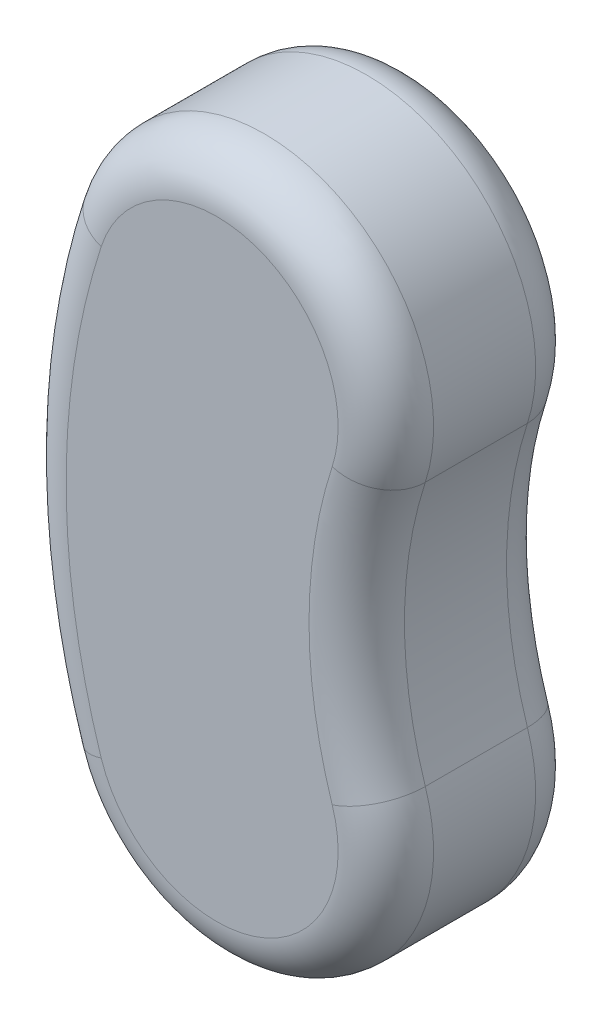
ISO-10303-21;
HEADER;
FILE_DESCRIPTION(('STEP AP214'),'2;1');
FILE_NAME('part.step','',(''),(''),'','','');
FILE_SCHEMA(('AUTOMOTIVE_DESIGN { 1 0 10303 214 1 1 1 1 }'));
ENDSEC;
DATA;
#1=APPLICATION_CONTEXT('core data for automotive mechanical design processes');
#2=APPLICATION_PROTOCOL_DEFINITION('international standard','automotive_design',2000,#1);
#3=PRODUCT_CONTEXT('',#1,'mechanical');
#4=PRODUCT('Part','Part','',(#3));
#5=PRODUCT_RELATED_PRODUCT_CATEGORY('part','',(#4));
#6=PRODUCT_DEFINITION_FORMATION('','',#4);
#7=PRODUCT_DEFINITION_CONTEXT('part definition',#1,'design');
#8=PRODUCT_DEFINITION('design','',#6,#7);
#9=PRODUCT_DEFINITION_SHAPE('','',#8);
#10=(LENGTH_UNIT() NAMED_UNIT(*) SI_UNIT(.MILLI.,.METRE.));
#11=(NAMED_UNIT(*) PLANE_ANGLE_UNIT() SI_UNIT($,.RADIAN.));
#12=(NAMED_UNIT(*) SI_UNIT($,.STERADIAN.) SOLID_ANGLE_UNIT());
#13=UNCERTAINTY_MEASURE_WITH_UNIT(LENGTH_MEASURE(1.E-05),#10,'distance_accuracy_value','');
#14=(GEOMETRIC_REPRESENTATION_CONTEXT(3) GLOBAL_UNCERTAINTY_ASSIGNED_CONTEXT((#13)) GLOBAL_UNIT_ASSIGNED_CONTEXT((#10,
#11,#12)) REPRESENTATION_CONTEXT('',''));
#15=CARTESIAN_POINT('',(0.,0.,0.));
#16=DIRECTION('',(0.,0.,1.));
#17=DIRECTION('',(1.,0.,0.));
#18=AXIS2_PLACEMENT_3D('',#15,#16,#17);
#19=CARTESIAN_POINT('',(33.7181235793706,10.9448911500431,41.4));
#20=DIRECTION('',(0.,0.,-1.));
#21=DIRECTION('',(-1.,0.,0.));
#22=AXIS2_PLACEMENT_3D('',#19,#20,#21);
#23=CYLINDRICAL_SURFACE('',#22,35.45);
#24=DIRECTION('',(0.,0.,-1.));
#25=VECTOR('',#24,1.);
#26=CARTESIAN_POINT('',(0.,0.,41.4));
#27=LINE('',#26,#25);
#28=CARTESIAN_POINT('',(0.,0.,31.4));
#29=VERTEX_POINT('',#28);
#30=CARTESIAN_POINT('',(0.,0.,10.));
#31=VERTEX_POINT('',#30);
#32=EDGE_CURVE('E180',#29,#31,#27,.T.);
#33=ORIENTED_EDGE('',*,*,#32,.T.);
#34=CARTESIAN_POINT('',(33.7181235793706,10.9448911500431,10.));
#35=DIRECTION('',(0.,0.,-1.));
#36=DIRECTION('',(-1.,0.,0.));
#37=AXIS2_PLACEMENT_3D('',#34,#35,#36);
#38=CIRCLE('',#37,35.45);
#39=CARTESIAN_POINT('',(67.4362471587413,21.8897823000861,10.));
#40=VERTEX_POINT('',#39);
#41=EDGE_CURVE('E133',#31,#40,#38,.F.);
#42=ORIENTED_EDGE('',*,*,#41,.T.);
#43=DIRECTION('',(0.,0.,-1.));
#44=VECTOR('',#43,1.);
#45=CARTESIAN_POINT('',(67.4362471587413,21.8897823000861,41.4));
#46=LINE('',#45,#44);
#47=CARTESIAN_POINT('',(67.4362471587413,21.8897823000861,31.4));
#48=VERTEX_POINT('',#47);
#49=EDGE_CURVE('E113',#48,#40,#46,.T.);
#50=ORIENTED_EDGE('',*,*,#49,.F.);
#51=CARTESIAN_POINT('',(33.7181235793706,10.9448911500431,31.4));
#52=DIRECTION('',(0.,0.,-1.));
#53=DIRECTION('',(-1.,0.,0.));
#54=AXIS2_PLACEMENT_3D('',#51,#52,#53);
#55=CIRCLE('',#54,35.45);
#56=EDGE_CURVE('E127',#48,#29,#55,.T.);
#57=ORIENTED_EDGE('',*,*,#56,.T.);
#58=EDGE_LOOP('',(#33,#42,#50,#57));
#59=FACE_BOUND('',#58,.T.);
#60=ADVANCED_FACE('F44',(#59),#23,.T.);
#61=CARTESIAN_POINT('',(152.47980390724,49.494891150043,41.4));
#62=DIRECTION('',(0.,0.,-1.));
#63=DIRECTION('',(-1.,0.,0.));
#64=AXIS2_PLACEMENT_3D('',#61,#62,#63);
#65=CYLINDRICAL_SURFACE('',#64,89.4116803278691);
#66=ORIENTED_EDGE('',*,*,#49,.T.);
#67=CARTESIAN_POINT('',(152.47980390724,49.494891150043,10.));
#68=DIRECTION('',(0.,0.,-1.));
#69=DIRECTION('',(-1.,0.,0.));
#70=AXIS2_PLACEMENT_3D('',#67,#68,#69);
#71=CIRCLE('',#70,89.4116803278691);
#72=CARTESIAN_POINT('',(67.4362471587413,77.1,10.));
#73=VERTEX_POINT('',#72);
#74=EDGE_CURVE('E11',#40,#73,#71,.T.);
#75=ORIENTED_EDGE('',*,*,#74,.T.);
#76=DIRECTION('',(0.,0.,-1.));
#77=VECTOR('',#76,1.);
#78=CARTESIAN_POINT('',(67.4362471587413,77.1,41.4));
#79=LINE('',#78,#77);
#80=CARTESIAN_POINT('',(67.4362471587413,77.1,31.4));
#81=VERTEX_POINT('',#80);
#82=EDGE_CURVE('E120',#81,#73,#79,.T.);
#83=ORIENTED_EDGE('',*,*,#82,.F.);
#84=CARTESIAN_POINT('',(152.47980390724,49.494891150043,31.4));
#85=DIRECTION('',(0.,0.,-1.));
#86=DIRECTION('',(-1.,0.,0.));
#87=AXIS2_PLACEMENT_3D('',#84,#85,#86);
#88=CIRCLE('',#87,89.4116803278691);
#89=EDGE_CURVE('E54',#81,#48,#88,.F.);
#90=ORIENTED_EDGE('',*,*,#89,.T.);
#91=EDGE_LOOP('',(#66,#75,#83,#90));
#92=FACE_BOUND('',#91,.T.);
#93=ADVANCED_FACE('F114',(#92),#65,.F.);
#94=CARTESIAN_POINT('',(33.7181235793706,88.044891150043,41.4));
#95=DIRECTION('',(0.,0.,-1.));
#96=DIRECTION('',(-1.,0.,0.));
#97=AXIS2_PLACEMENT_3D('',#94,#95,#96);
#98=CYLINDRICAL_SURFACE('',#97,35.45);
#99=ORIENTED_EDGE('',*,*,#82,.T.);
#100=CARTESIAN_POINT('',(33.7181235793706,88.044891150043,10.));
#101=DIRECTION('',(0.,0.,-1.));
#102=DIRECTION('',(-1.,0.,0.));
#103=AXIS2_PLACEMENT_3D('',#100,#101,#102);
#104=CIRCLE('',#103,35.45);
#105=CARTESIAN_POINT('',(0.,98.9897823000861,10.));
#106=VERTEX_POINT('',#105);
#107=EDGE_CURVE('E218',#73,#106,#104,.F.);
#108=ORIENTED_EDGE('',*,*,#107,.T.);
#109=DIRECTION('',(0.,0.,-1.));
#110=VECTOR('',#109,1.);
#111=CARTESIAN_POINT('',(0.,98.9897823000861,41.4));
#112=LINE('',#111,#110);
#113=CARTESIAN_POINT('',(0.,98.9897823000861,31.4));
#114=VERTEX_POINT('',#113);
#115=EDGE_CURVE('E183',#114,#106,#112,.T.);
#116=ORIENTED_EDGE('',*,*,#115,.F.);
#117=CARTESIAN_POINT('',(33.7181235793706,88.044891150043,31.4));
#118=DIRECTION('',(0.,0.,-1.));
#119=DIRECTION('',(-1.,0.,0.));
#120=AXIS2_PLACEMENT_3D('',#117,#118,#119);
#121=CIRCLE('',#120,35.45);
#122=EDGE_CURVE('E211',#114,#81,#121,.T.);
#123=ORIENTED_EDGE('',*,*,#122,.T.);
#124=EDGE_LOOP('',(#99,#108,#116,#123));
#125=FACE_BOUND('',#124,.T.);
#126=ADVANCED_FACE('F233',(#125),#98,.T.);
#127=CARTESIAN_POINT('',(152.47980390724,49.494891150043,41.4));
#128=DIRECTION('',(0.,0.,-1.));
#129=DIRECTION('',(-1.,0.,0.));
#130=AXIS2_PLACEMENT_3D('',#127,#128,#129);
#131=CYLINDRICAL_SURFACE('',#130,160.311680327869);
#132=ORIENTED_EDGE('',*,*,#115,.T.);
#133=CARTESIAN_POINT('',(152.47980390724,49.494891150043,10.));
#134=DIRECTION('',(0.,0.,-1.));
#135=DIRECTION('',(-1.,0.,0.));
#136=AXIS2_PLACEMENT_3D('',#133,#134,#135);
#137=CIRCLE('',#136,160.311680327869);
#138=EDGE_CURVE('E206',#106,#31,#137,.F.);
#139=ORIENTED_EDGE('',*,*,#138,.T.);
#140=ORIENTED_EDGE('',*,*,#32,.F.);
#141=CARTESIAN_POINT('',(152.47980390724,49.494891150043,31.4));
#142=DIRECTION('',(0.,0.,-1.));
#143=DIRECTION('',(-1.,0.,0.));
#144=AXIS2_PLACEMENT_3D('',#141,#142,#143);
#145=CIRCLE('',#144,160.311680327869);
#146=EDGE_CURVE('E210',#29,#114,#145,.T.);
#147=ORIENTED_EDGE('',*,*,#146,.T.);
#148=EDGE_LOOP('',(#132,#139,#140,#147));
#149=FACE_BOUND('',#148,.T.);
#150=ADVANCED_FACE('F235',(#149),#131,.T.);
#151=CARTESIAN_POINT('',(93.0989637433052,30.2198911500431,41.4));
#152=DIRECTION('',(0.,0.,-1.));
#153=DIRECTION('',(-1.,0.,0.));
#154=AXIS2_PLACEMENT_3D('',#151,#152,#153);
#155=PLANE('',#154);
#156=CARTESIAN_POINT('',(152.47980390724,49.494891150043,41.4));
#157=DIRECTION('',(0.,0.,-1.));
#158=DIRECTION('',(-1.,0.,0.));
#159=AXIS2_PLACEMENT_3D('',#156,#157,#158);
#160=CIRCLE('',#159,150.311680327869);
#161=CARTESIAN_POINT('',(9.51145940179707,95.9023658966889,41.4));
#162=VERTEX_POINT('',#161);
#163=CARTESIAN_POINT('',(9.51145940179711,3.08741640339717,41.4));
#164=VERTEX_POINT('',#163);
#165=EDGE_CURVE('E63',#162,#164,#160,.F.);
#166=ORIENTED_EDGE('',*,*,#165,.T.);
#167=CARTESIAN_POINT('',(33.7181235793706,10.9448911500431,41.4));
#168=DIRECTION('',(0.,0.,-1.));
#169=DIRECTION('',(-1.,0.,0.));
#170=AXIS2_PLACEMENT_3D('',#167,#168,#169);
#171=CIRCLE('',#170,25.45);
#172=CARTESIAN_POINT('',(57.9247877569442,18.8023658966889,41.4));
#173=VERTEX_POINT('',#172);
#174=EDGE_CURVE('E121',#164,#173,#171,.F.);
#175=ORIENTED_EDGE('',*,*,#174,.T.);
#176=CARTESIAN_POINT('',(152.47980390724,49.494891150043,41.4));
#177=DIRECTION('',(0.,0.,-1.));
#178=DIRECTION('',(-1.,0.,0.));
#179=AXIS2_PLACEMENT_3D('',#176,#177,#178);
#180=CIRCLE('',#179,99.4116803278691);
#181=CARTESIAN_POINT('',(57.9247877569442,80.1874164033972,41.4));
#182=VERTEX_POINT('',#181);
#183=EDGE_CURVE('E147',#173,#182,#180,.T.);
#184=ORIENTED_EDGE('',*,*,#183,.T.);
#185=CARTESIAN_POINT('',(33.7181235793706,88.044891150043,41.4));
#186=DIRECTION('',(0.,0.,-1.));
#187=DIRECTION('',(-1.,0.,0.));
#188=AXIS2_PLACEMENT_3D('',#185,#186,#187);
#189=CIRCLE('',#188,25.45);
#190=EDGE_CURVE('E66',#182,#162,#189,.F.);
#191=ORIENTED_EDGE('',*,*,#190,.T.);
#192=EDGE_LOOP('',(#166,#175,#184,#191));
#193=FACE_BOUND('',#192,.T.);
#194=ADVANCED_FACE('F226',(#193),#155,.F.);
#195=CARTESIAN_POINT('',(93.0989637433052,30.2198911500431,0.));
#196=DIRECTION('',(0.,0.,-1.));
#197=DIRECTION('',(-1.,0.,0.));
#198=AXIS2_PLACEMENT_3D('',#195,#196,#197);
#199=PLANE('',#198);
#200=CARTESIAN_POINT('',(152.47980390724,49.494891150043,0.));
#201=DIRECTION('',(0.,0.,-1.));
#202=DIRECTION('',(-1.,0.,0.));
#203=AXIS2_PLACEMENT_3D('',#200,#201,#202);
#204=CIRCLE('',#203,99.4116803278691);
#205=CARTESIAN_POINT('',(57.9247877569442,80.1874164033972,0.));
#206=VERTEX_POINT('',#205);
#207=CARTESIAN_POINT('',(57.9247877569442,18.8023658966889,0.));
#208=VERTEX_POINT('',#207);
#209=EDGE_CURVE('E191',#206,#208,#204,.F.);
#210=ORIENTED_EDGE('',*,*,#209,.T.);
#211=CARTESIAN_POINT('',(33.7181235793706,10.9448911500431,0.));
#212=DIRECTION('',(0.,0.,-1.));
#213=DIRECTION('',(-1.,0.,0.));
#214=AXIS2_PLACEMENT_3D('',#211,#212,#213);
#215=CIRCLE('',#214,25.45);
#216=CARTESIAN_POINT('',(9.5114594017971,3.08741640339717,0.));
#217=VERTEX_POINT('',#216);
#218=EDGE_CURVE('E201',#208,#217,#215,.T.);
#219=ORIENTED_EDGE('',*,*,#218,.T.);
#220=CARTESIAN_POINT('',(152.47980390724,49.494891150043,0.));
#221=DIRECTION('',(0.,0.,-1.));
#222=DIRECTION('',(-1.,0.,0.));
#223=AXIS2_PLACEMENT_3D('',#220,#221,#222);
#224=CIRCLE('',#223,150.311680327869);
#225=CARTESIAN_POINT('',(9.51145940179707,95.9023658966889,0.));
#226=VERTEX_POINT('',#225);
#227=EDGE_CURVE('E196',#217,#226,#224,.T.);
#228=ORIENTED_EDGE('',*,*,#227,.T.);
#229=CARTESIAN_POINT('',(33.7181235793706,88.044891150043,0.));
#230=DIRECTION('',(0.,0.,-1.));
#231=DIRECTION('',(-1.,0.,0.));
#232=AXIS2_PLACEMENT_3D('',#229,#230,#231);
#233=CIRCLE('',#232,25.45);
#234=EDGE_CURVE('E200',#226,#206,#233,.T.);
#235=ORIENTED_EDGE('',*,*,#234,.T.);
#236=EDGE_LOOP('',(#210,#219,#228,#235));
#237=FACE_BOUND('',#236,.T.);
#238=ADVANCED_FACE('F259',(#237),#199,.T.);
#239=CARTESIAN_POINT('',(33.7181235793706,88.044891150043,10.));
#240=DIRECTION('',(0.,0.,-1.));
#241=DIRECTION('',(-1.,0.,0.));
#242=AXIS2_PLACEMENT_3D('',#239,#240,#241);
#243=TOROIDAL_SURFACE('',#242,25.45,10.);
#244=CARTESIAN_POINT('',(57.9247877569442,80.1874164033972,10.));
#245=DIRECTION('',(-0.308741640339719,-0.951145940179708,0.));
#246=DIRECTION('',(0.951145940179708,-0.308741640339719,0.));
#247=AXIS2_PLACEMENT_3D('',#244,#245,#246);
#248=CIRCLE('',#247,10.);
#249=EDGE_CURVE('E166',#206,#73,#248,.T.);
#250=ORIENTED_EDGE('',*,*,#249,.F.);
#251=ORIENTED_EDGE('',*,*,#234,.F.);
#252=CARTESIAN_POINT('',(9.51145940179707,95.9023658966889,10.));
#253=DIRECTION('',(-0.30874164033972,-0.951145940179707,0.));
#254=DIRECTION('',(0.951145940179707,-0.30874164033972,0.));
#255=AXIS2_PLACEMENT_3D('',#252,#253,#254);
#256=CIRCLE('',#255,10.);
#257=EDGE_CURVE('E153',#106,#226,#256,.T.);
#258=ORIENTED_EDGE('',*,*,#257,.F.);
#259=ORIENTED_EDGE('',*,*,#107,.F.);
#260=EDGE_LOOP('',(#250,#251,#258,#259));
#261=FACE_BOUND('',#260,.T.);
#262=ADVANCED_FACE('F240',(#261),#243,.T.);
#263=CARTESIAN_POINT('',(152.47980390724,49.494891150043,10.));
#264=DIRECTION('',(0.,0.,-1.));
#265=DIRECTION('',(-1.,0.,0.));
#266=AXIS2_PLACEMENT_3D('',#263,#264,#265);
#267=TOROIDAL_SURFACE('',#266,150.311680327869,10.);
#268=ORIENTED_EDGE('',*,*,#257,.T.);
#269=ORIENTED_EDGE('',*,*,#227,.F.);
#270=CARTESIAN_POINT('',(9.51145940179711,3.08741640339716,10.));
#271=DIRECTION('',(0.30874164033972,-0.951145940179707,0.));
#272=DIRECTION('',(0.951145940179707,0.30874164033972,0.));
#273=AXIS2_PLACEMENT_3D('',#270,#271,#272);
#274=CIRCLE('',#273,10.);
#275=EDGE_CURVE('E162',#31,#217,#274,.T.);
#276=ORIENTED_EDGE('',*,*,#275,.F.);
#277=ORIENTED_EDGE('',*,*,#138,.F.);
#278=EDGE_LOOP('',(#268,#269,#276,#277));
#279=FACE_BOUND('',#278,.T.);
#280=ADVANCED_FACE('F236',(#279),#267,.T.);
#281=CARTESIAN_POINT('',(152.47980390724,49.494891150043,10.));
#282=DIRECTION('',(0.,0.,-1.));
#283=DIRECTION('',(-1.,0.,0.));
#284=AXIS2_PLACEMENT_3D('',#281,#282,#283);
#285=TOROIDAL_SURFACE('',#284,99.4116803278691,10.);
#286=ORIENTED_EDGE('',*,*,#249,.T.);
#287=ORIENTED_EDGE('',*,*,#74,.F.);
#288=CARTESIAN_POINT('',(57.9247877569442,18.8023658966889,10.));
#289=DIRECTION('',(0.308741640339719,-0.951145940179708,0.));
#290=DIRECTION('',(0.951145940179708,0.308741640339719,0.));
#291=AXIS2_PLACEMENT_3D('',#288,#289,#290);
#292=CIRCLE('',#291,10.);
#293=EDGE_CURVE('E156',#208,#40,#292,.T.);
#294=ORIENTED_EDGE('',*,*,#293,.F.);
#295=ORIENTED_EDGE('',*,*,#209,.F.);
#296=EDGE_LOOP('',(#286,#287,#294,#295));
#297=FACE_BOUND('',#296,.T.);
#298=ADVANCED_FACE('F245',(#297),#285,.T.);
#299=CARTESIAN_POINT('',(33.7181235793706,10.9448911500431,10.));
#300=DIRECTION('',(0.,0.,-1.));
#301=DIRECTION('',(-1.,0.,0.));
#302=AXIS2_PLACEMENT_3D('',#299,#300,#301);
#303=TOROIDAL_SURFACE('',#302,25.45,10.);
#304=ORIENTED_EDGE('',*,*,#275,.T.);
#305=ORIENTED_EDGE('',*,*,#218,.F.);
#306=ORIENTED_EDGE('',*,*,#293,.T.);
#307=ORIENTED_EDGE('',*,*,#41,.F.);
#308=EDGE_LOOP('',(#304,#305,#306,#307));
#309=FACE_BOUND('',#308,.T.);
#310=ADVANCED_FACE('F238',(#309),#303,.T.);
#311=CARTESIAN_POINT('',(33.7181235793706,88.044891150043,31.4));
#312=DIRECTION('',(0.,0.,-1.));
#313=DIRECTION('',(-1.,0.,0.));
#314=AXIS2_PLACEMENT_3D('',#311,#312,#313);
#315=TOROIDAL_SURFACE('',#314,25.45,10.);
#316=CARTESIAN_POINT('',(57.9247877569442,80.1874164033972,31.4));
#317=DIRECTION('',(-0.308741640339719,-0.951145940179708,0.));
#318=DIRECTION('',(0.951145940179708,-0.308741640339719,0.));
#319=AXIS2_PLACEMENT_3D('',#316,#317,#318);
#320=CIRCLE('',#319,10.);
#321=EDGE_CURVE('E148',#81,#182,#320,.T.);
#322=ORIENTED_EDGE('',*,*,#321,.F.);
#323=ORIENTED_EDGE('',*,*,#122,.F.);
#324=CARTESIAN_POINT('',(9.51145940179707,95.9023658966889,31.4));
#325=DIRECTION('',(-0.30874164033972,-0.951145940179707,0.));
#326=DIRECTION('',(0.951145940179707,-0.30874164033972,0.));
#327=AXIS2_PLACEMENT_3D('',#324,#325,#326);
#328=CIRCLE('',#327,10.);
#329=EDGE_CURVE('E47',#162,#114,#328,.T.);
#330=ORIENTED_EDGE('',*,*,#329,.F.);
#331=ORIENTED_EDGE('',*,*,#190,.F.);
#332=EDGE_LOOP('',(#322,#323,#330,#331));
#333=FACE_BOUND('',#332,.T.);
#334=ADVANCED_FACE('F50',(#333),#315,.T.);
#335=CARTESIAN_POINT('',(152.47980390724,49.494891150043,31.4));
#336=DIRECTION('',(0.,0.,-1.));
#337=DIRECTION('',(-1.,0.,0.));
#338=AXIS2_PLACEMENT_3D('',#335,#336,#337);
#339=TOROIDAL_SURFACE('',#338,150.311680327869,10.);
#340=ORIENTED_EDGE('',*,*,#329,.T.);
#341=ORIENTED_EDGE('',*,*,#146,.F.);
#342=CARTESIAN_POINT('',(9.51145940179711,3.08741640339717,31.4));
#343=DIRECTION('',(0.308741640339721,-0.951145940179707,0.));
#344=DIRECTION('',(0.951145940179707,0.308741640339721,0.));
#345=AXIS2_PLACEMENT_3D('',#342,#343,#344);
#346=CIRCLE('',#345,10.);
#347=EDGE_CURVE('E141',#164,#29,#346,.T.);
#348=ORIENTED_EDGE('',*,*,#347,.F.);
#349=ORIENTED_EDGE('',*,*,#165,.F.);
#350=EDGE_LOOP('',(#340,#341,#348,#349));
#351=FACE_BOUND('',#350,.T.);
#352=ADVANCED_FACE('F227',(#351),#339,.T.);
#353=CARTESIAN_POINT('',(152.47980390724,49.494891150043,31.4));
#354=DIRECTION('',(0.,0.,-1.));
#355=DIRECTION('',(-1.,0.,0.));
#356=AXIS2_PLACEMENT_3D('',#353,#354,#355);
#357=TOROIDAL_SURFACE('',#356,99.4116803278691,10.);
#358=ORIENTED_EDGE('',*,*,#321,.T.);
#359=ORIENTED_EDGE('',*,*,#183,.F.);
#360=CARTESIAN_POINT('',(57.9247877569442,18.8023658966889,31.4));
#361=DIRECTION('',(0.30874164033972,-0.951145940179707,0.));
#362=DIRECTION('',(0.951145940179707,0.30874164033972,0.));
#363=AXIS2_PLACEMENT_3D('',#360,#361,#362);
#364=CIRCLE('',#363,10.);
#365=EDGE_CURVE('E137',#48,#173,#364,.T.);
#366=ORIENTED_EDGE('',*,*,#365,.F.);
#367=ORIENTED_EDGE('',*,*,#89,.F.);
#368=EDGE_LOOP('',(#358,#359,#366,#367));
#369=FACE_BOUND('',#368,.T.);
#370=ADVANCED_FACE('F144',(#369),#357,.T.);
#371=CARTESIAN_POINT('',(33.7181235793706,10.9448911500431,31.4));
#372=DIRECTION('',(0.,0.,-1.));
#373=DIRECTION('',(-1.,0.,0.));
#374=AXIS2_PLACEMENT_3D('',#371,#372,#373);
#375=TOROIDAL_SURFACE('',#374,25.45,10.);
#376=ORIENTED_EDGE('',*,*,#347,.T.);
#377=ORIENTED_EDGE('',*,*,#56,.F.);
#378=ORIENTED_EDGE('',*,*,#365,.T.);
#379=ORIENTED_EDGE('',*,*,#174,.F.);
#380=EDGE_LOOP('',(#376,#377,#378,#379));
#381=FACE_BOUND('',#380,.T.);
#382=ADVANCED_FACE('F140',(#381),#375,.T.);
#383=CLOSED_SHELL('',(#60,#93,#126,#150,#194,#238,#262,#280,#298,#310,#334,#352,#370,#382));
#384=MANIFOLD_SOLID_BREP('B2',#383);
#385=ADVANCED_BREP_SHAPE_REPRESENTATION('',(#18,#384),#14);
#386=SHAPE_DEFINITION_REPRESENTATION(#9,#385);
ENDSEC;
END-ISO-10303-21;
